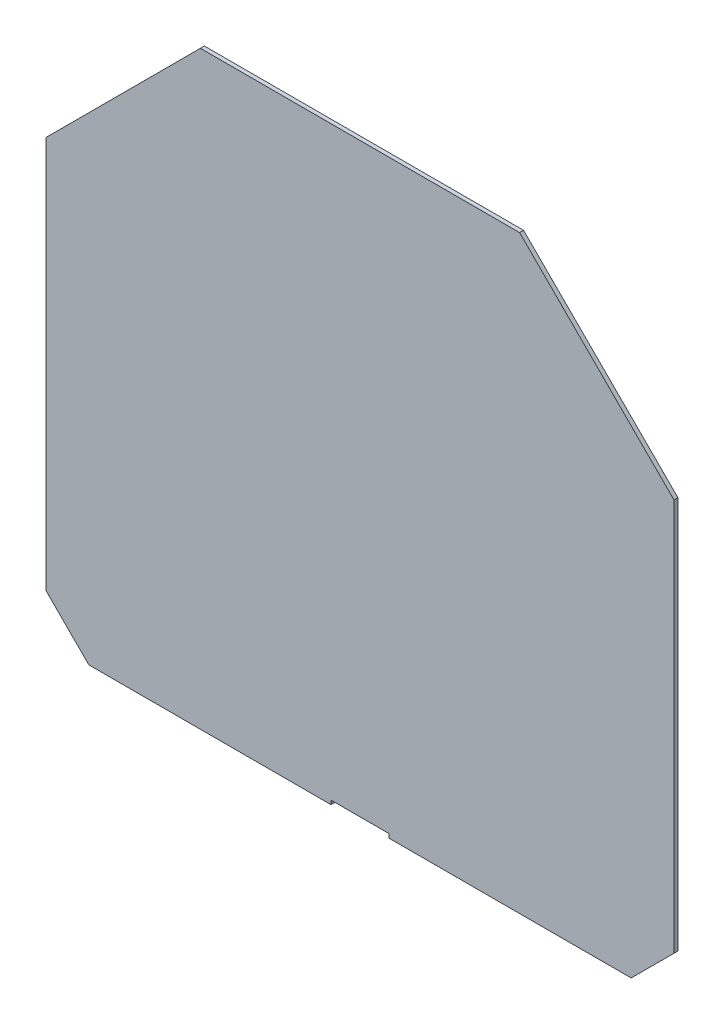
ISO-10303-21;
HEADER;
FILE_DESCRIPTION(('STEP AP214'),'2;1');
FILE_NAME('part.step','',(''),(''),'','','');
FILE_SCHEMA(('AUTOMOTIVE_DESIGN { 1 0 10303 214 1 1 1 1 }'));
ENDSEC;
DATA;
#1=APPLICATION_CONTEXT('core data for automotive mechanical design processes');
#2=APPLICATION_PROTOCOL_DEFINITION('international standard','automotive_design',2000,#1);
#3=PRODUCT_CONTEXT('',#1,'mechanical');
#4=PRODUCT('Part','Part','',(#3));
#5=PRODUCT_RELATED_PRODUCT_CATEGORY('part','',(#4));
#6=PRODUCT_DEFINITION_FORMATION('','',#4);
#7=PRODUCT_DEFINITION_CONTEXT('part definition',#1,'design');
#8=PRODUCT_DEFINITION('design','',#6,#7);
#9=PRODUCT_DEFINITION_SHAPE('','',#8);
#10=(LENGTH_UNIT() NAMED_UNIT(*) SI_UNIT(.MILLI.,.METRE.));
#11=(NAMED_UNIT(*) PLANE_ANGLE_UNIT() SI_UNIT($,.RADIAN.));
#12=(NAMED_UNIT(*) SI_UNIT($,.STERADIAN.) SOLID_ANGLE_UNIT());
#13=UNCERTAINTY_MEASURE_WITH_UNIT(LENGTH_MEASURE(1.E-05),#10,'distance_accuracy_value','');
#14=(GEOMETRIC_REPRESENTATION_CONTEXT(3) GLOBAL_UNCERTAINTY_ASSIGNED_CONTEXT((#13)) GLOBAL_UNIT_ASSIGNED_CONTEXT((#10,
#11,#12)) REPRESENTATION_CONTEXT('',''));
#15=CARTESIAN_POINT('',(0.,0.,0.));
#16=DIRECTION('',(0.,0.,1.));
#17=DIRECTION('',(1.,0.,0.));
#18=AXIS2_PLACEMENT_3D('',#15,#16,#17);
#19=CARTESIAN_POINT('',(-22.,-71.000002576039,3.));
#20=DIRECTION('',(-1.,0.,0.));
#21=DIRECTION('',(0.,-1.,0.));
#22=AXIS2_PLACEMENT_3D('',#19,#20,#21);
#23=PLANE('',#22);
#24=DIRECTION('',(0.,1.,0.));
#25=VECTOR('',#24,1.);
#26=CARTESIAN_POINT('',(-22.,-71.000002576039,0.));
#27=LINE('',#26,#25);
#28=CARTESIAN_POINT('',(-22.,-71.000002576039,0.));
#29=VERTEX_POINT('',#28);
#30=CARTESIAN_POINT('',(-22.,-68.000002576039,0.));
#31=VERTEX_POINT('',#30);
#32=EDGE_CURVE('E153',#29,#31,#27,.T.);
#33=ORIENTED_EDGE('',*,*,#32,.T.);
#34=DIRECTION('',(0.,0.,-1.));
#35=VECTOR('',#34,1.);
#36=CARTESIAN_POINT('',(-22.,-68.000002576039,3.));
#37=LINE('',#36,#35);
#38=CARTESIAN_POINT('',(-22.,-68.000002576039,3.));
#39=VERTEX_POINT('',#38);
#40=EDGE_CURVE('E11',#39,#31,#37,.T.);
#41=ORIENTED_EDGE('',*,*,#40,.F.);
#42=DIRECTION('',(0.,1.,0.));
#43=VECTOR('',#42,1.);
#44=CARTESIAN_POINT('',(-22.,-71.000002576039,3.));
#45=LINE('',#44,#43);
#46=CARTESIAN_POINT('',(-22.,-71.000002576039,3.));
#47=VERTEX_POINT('',#46);
#48=EDGE_CURVE('E175',#47,#39,#45,.T.);
#49=ORIENTED_EDGE('',*,*,#48,.F.);
#50=DIRECTION('',(0.,0.,-1.));
#51=VECTOR('',#50,1.);
#52=CARTESIAN_POINT('',(-22.,-71.000002576039,3.));
#53=LINE('',#52,#51);
#54=EDGE_CURVE('E149',#47,#29,#53,.T.);
#55=ORIENTED_EDGE('',*,*,#54,.T.);
#56=EDGE_LOOP('',(#33,#41,#49,#55));
#57=FACE_BOUND('',#56,.T.);
#58=ADVANCED_FACE('F33',(#57),#23,.F.);
#59=CARTESIAN_POINT('',(-22.,-68.000002576039,3.));
#60=DIRECTION('',(0.,1.,0.));
#61=DIRECTION('',(0.,0.,1.));
#62=AXIS2_PLACEMENT_3D('',#59,#60,#61);
#63=PLANE('',#62);
#64=DIRECTION('',(1.,0.,0.));
#65=VECTOR('',#64,1.);
#66=CARTESIAN_POINT('',(-22.,-68.000002576039,0.));
#67=LINE('',#66,#65);
#68=CARTESIAN_POINT('',(22.,-68.000002576039,0.));
#69=VERTEX_POINT('',#68);
#70=EDGE_CURVE('E156',#31,#69,#67,.T.);
#71=ORIENTED_EDGE('',*,*,#70,.T.);
#72=DIRECTION('',(0.,0.,-1.));
#73=VECTOR('',#72,1.);
#74=CARTESIAN_POINT('',(22.,-68.000002576039,3.));
#75=LINE('',#74,#73);
#76=CARTESIAN_POINT('',(22.,-68.000002576039,3.));
#77=VERTEX_POINT('',#76);
#78=EDGE_CURVE('E41',#77,#69,#75,.T.);
#79=ORIENTED_EDGE('',*,*,#78,.F.);
#80=DIRECTION('',(1.,0.,0.));
#81=VECTOR('',#80,1.);
#82=CARTESIAN_POINT('',(-22.,-68.000002576039,3.));
#83=LINE('',#82,#81);
#84=EDGE_CURVE('E104',#39,#77,#83,.T.);
#85=ORIENTED_EDGE('',*,*,#84,.F.);
#86=ORIENTED_EDGE('',*,*,#40,.T.);
#87=EDGE_LOOP('',(#71,#79,#85,#86));
#88=FACE_BOUND('',#87,.T.);
#89=ADVANCED_FACE('F253',(#88),#63,.F.);
#90=CARTESIAN_POINT('',(22.,-68.000002576039,3.));
#91=DIRECTION('',(1.,0.,0.));
#92=DIRECTION('',(0.,1.,0.));
#93=AXIS2_PLACEMENT_3D('',#90,#91,#92);
#94=PLANE('',#93);
#95=DIRECTION('',(0.,-1.,0.));
#96=VECTOR('',#95,1.);
#97=CARTESIAN_POINT('',(22.,-68.000002576039,0.));
#98=LINE('',#97,#96);
#99=CARTESIAN_POINT('',(22.,-71.000002576039,0.));
#100=VERTEX_POINT('',#99);
#101=EDGE_CURVE('E158',#69,#100,#98,.T.);
#102=ORIENTED_EDGE('',*,*,#101,.T.);
#103=DIRECTION('',(0.,0.,-1.));
#104=VECTOR('',#103,1.);
#105=CARTESIAN_POINT('',(22.,-71.000002576039,3.));
#106=LINE('',#105,#104);
#107=CARTESIAN_POINT('',(22.,-71.000002576039,3.));
#108=VERTEX_POINT('',#107);
#109=EDGE_CURVE('E194',#108,#100,#106,.T.);
#110=ORIENTED_EDGE('',*,*,#109,.F.);
#111=DIRECTION('',(0.,-1.,0.));
#112=VECTOR('',#111,1.);
#113=CARTESIAN_POINT('',(22.,-68.000002576039,3.));
#114=LINE('',#113,#112);
#115=EDGE_CURVE('E202',#77,#108,#114,.T.);
#116=ORIENTED_EDGE('',*,*,#115,.F.);
#117=ORIENTED_EDGE('',*,*,#78,.T.);
#118=EDGE_LOOP('',(#102,#110,#116,#117));
#119=FACE_BOUND('',#118,.T.);
#120=ADVANCED_FACE('F200',(#119),#94,.F.);
#121=CARTESIAN_POINT('',(22.,-71.000002576039,3.));
#122=DIRECTION('',(0.,1.,0.));
#123=DIRECTION('',(0.,0.,1.));
#124=AXIS2_PLACEMENT_3D('',#121,#122,#123);
#125=PLANE('',#124);
#126=DIRECTION('',(1.,0.,0.));
#127=VECTOR('',#126,1.);
#128=CARTESIAN_POINT('',(22.,-71.000002576039,0.));
#129=LINE('',#128,#127);
#130=CARTESIAN_POINT('',(205.356381253795,-71.000002576039,0.));
#131=VERTEX_POINT('',#130);
#132=EDGE_CURVE('E160',#100,#131,#129,.T.);
#133=ORIENTED_EDGE('',*,*,#132,.T.);
#134=DIRECTION('',(0.,0.,-1.));
#135=VECTOR('',#134,1.);
#136=CARTESIAN_POINT('',(205.356381253795,-71.000002576039,3.));
#137=LINE('',#136,#135);
#138=CARTESIAN_POINT('',(205.356381253795,-71.000002576039,3.));
#139=VERTEX_POINT('',#138);
#140=EDGE_CURVE('E191',#139,#131,#137,.T.);
#141=ORIENTED_EDGE('',*,*,#140,.F.);
#142=DIRECTION('',(1.,0.,0.));
#143=VECTOR('',#142,1.);
#144=CARTESIAN_POINT('',(22.,-71.000002576039,3.));
#145=LINE('',#144,#143);
#146=EDGE_CURVE('E220',#108,#139,#145,.T.);
#147=ORIENTED_EDGE('',*,*,#146,.F.);
#148=ORIENTED_EDGE('',*,*,#109,.T.);
#149=EDGE_LOOP('',(#133,#141,#147,#148));
#150=FACE_BOUND('',#149,.T.);
#151=ADVANCED_FACE('F211',(#150),#125,.F.);
#152=CARTESIAN_POINT('',(205.356381253795,-71.000002576039,3.));
#153=DIRECTION('',(-0.707106781186548,0.707106781186547,0.));
#154=DIRECTION('',(-0.707106781186547,-0.707106781186548,0.));
#155=AXIS2_PLACEMENT_3D('',#152,#153,#154);
#156=PLANE('',#155);
#157=DIRECTION('',(0.707106781186547,0.707106781186548,0.));
#158=VECTOR('',#157,1.);
#159=CARTESIAN_POINT('',(205.356381253795,-71.000002576039,0.));
#160=LINE('',#159,#158);
#161=CARTESIAN_POINT('',(237.80483880146,-38.5515450283748,0.));
#162=VERTEX_POINT('',#161);
#163=EDGE_CURVE('E162',#131,#162,#160,.T.);
#164=ORIENTED_EDGE('',*,*,#163,.T.);
#165=DIRECTION('',(0.,0.,-1.));
#166=VECTOR('',#165,1.);
#167=CARTESIAN_POINT('',(237.80483880146,-38.5515450283748,3.));
#168=LINE('',#167,#166);
#169=CARTESIAN_POINT('',(237.80483880146,-38.5515450283748,3.));
#170=VERTEX_POINT('',#169);
#171=EDGE_CURVE('E188',#170,#162,#168,.T.);
#172=ORIENTED_EDGE('',*,*,#171,.F.);
#173=DIRECTION('',(0.707106781186547,0.707106781186548,0.));
#174=VECTOR('',#173,1.);
#175=CARTESIAN_POINT('',(205.356381253795,-71.000002576039,3.));
#176=LINE('',#175,#174);
#177=EDGE_CURVE('E217',#139,#170,#176,.T.);
#178=ORIENTED_EDGE('',*,*,#177,.F.);
#179=ORIENTED_EDGE('',*,*,#140,.T.);
#180=EDGE_LOOP('',(#164,#172,#178,#179));
#181=FACE_BOUND('',#180,.T.);
#182=ADVANCED_FACE('F215',(#181),#156,.F.);
#183=CARTESIAN_POINT('',(237.80483880146,-38.5515450283748,3.));
#184=DIRECTION('',(-1.,0.,0.));
#185=DIRECTION('',(0.,0.,1.));
#186=AXIS2_PLACEMENT_3D('',#183,#184,#185);
#187=PLANE('',#186);
#188=DIRECTION('',(0.,1.,0.));
#189=VECTOR('',#188,1.);
#190=CARTESIAN_POINT('',(237.80483880146,-38.5515450283748,0.));
#191=LINE('',#190,#189);
#192=CARTESIAN_POINT('',(237.80483880146,258.722127635355,0.));
#193=VERTEX_POINT('',#192);
#194=EDGE_CURVE('E164',#162,#193,#191,.T.);
#195=ORIENTED_EDGE('',*,*,#194,.T.);
#196=DIRECTION('',(0.,0.,-1.));
#197=VECTOR('',#196,1.);
#198=CARTESIAN_POINT('',(237.80483880146,258.722127635355,3.));
#199=LINE('',#198,#197);
#200=CARTESIAN_POINT('',(237.80483880146,258.722127635355,3.));
#201=VERTEX_POINT('',#200);
#202=EDGE_CURVE('E185',#201,#193,#199,.T.);
#203=ORIENTED_EDGE('',*,*,#202,.F.);
#204=DIRECTION('',(0.,1.,0.));
#205=VECTOR('',#204,1.);
#206=CARTESIAN_POINT('',(237.80483880146,-38.5515450283748,3.));
#207=LINE('',#206,#205);
#208=EDGE_CURVE('E219',#170,#201,#207,.T.);
#209=ORIENTED_EDGE('',*,*,#208,.F.);
#210=ORIENTED_EDGE('',*,*,#171,.T.);
#211=EDGE_LOOP('',(#195,#203,#209,#210));
#212=FACE_BOUND('',#211,.T.);
#213=ADVANCED_FACE('F266',(#212),#187,.F.);
#214=CARTESIAN_POINT('',(237.80483880146,258.722127635355,3.));
#215=DIRECTION('',(-0.707106781186551,-0.707106781186544,0.));
#216=DIRECTION('',(0.707106781186544,-0.707106781186551,0.));
#217=AXIS2_PLACEMENT_3D('',#214,#215,#216);
#218=PLANE('',#217);
#219=DIRECTION('',(-0.707106781186544,0.707106781186551,0.));
#220=VECTOR('',#219,1.);
#221=CARTESIAN_POINT('',(237.80483880146,258.722127635355,0.));
#222=LINE('',#221,#220);
#223=CARTESIAN_POINT('',(120.878213037941,375.648753398874,0.));
#224=VERTEX_POINT('',#223);
#225=EDGE_CURVE('E166',#193,#224,#222,.T.);
#226=ORIENTED_EDGE('',*,*,#225,.T.);
#227=DIRECTION('',(0.,0.,-1.));
#228=VECTOR('',#227,1.);
#229=CARTESIAN_POINT('',(120.878213037941,375.648753398874,3.));
#230=LINE('',#229,#228);
#231=CARTESIAN_POINT('',(120.878213037941,375.648753398874,3.));
#232=VERTEX_POINT('',#231);
#233=EDGE_CURVE('E182',#232,#224,#230,.T.);
#234=ORIENTED_EDGE('',*,*,#233,.F.);
#235=DIRECTION('',(-0.707106781186544,0.707106781186551,0.));
#236=VECTOR('',#235,1.);
#237=CARTESIAN_POINT('',(237.80483880146,258.722127635355,3.));
#238=LINE('',#237,#236);
#239=EDGE_CURVE('E222',#201,#232,#238,.T.);
#240=ORIENTED_EDGE('',*,*,#239,.F.);
#241=ORIENTED_EDGE('',*,*,#202,.T.);
#242=EDGE_LOOP('',(#226,#234,#240,#241));
#243=FACE_BOUND('',#242,.T.);
#244=ADVANCED_FACE('F269',(#243),#218,.F.);
#245=CARTESIAN_POINT('',(120.878213037941,375.648753398874,3.));
#246=DIRECTION('',(0.,-1.,0.));
#247=DIRECTION('',(0.,0.,-1.));
#248=AXIS2_PLACEMENT_3D('',#245,#246,#247);
#249=PLANE('',#248);
#250=DIRECTION('',(-1.,0.,0.));
#251=VECTOR('',#250,1.);
#252=CARTESIAN_POINT('',(120.878213037941,375.648753398874,0.));
#253=LINE('',#252,#251);
#254=CARTESIAN_POINT('',(-120.878213037941,375.648753398874,0.));
#255=VERTEX_POINT('',#254);
#256=EDGE_CURVE('E168',#224,#255,#253,.T.);
#257=ORIENTED_EDGE('',*,*,#256,.T.);
#258=DIRECTION('',(0.,0.,-1.));
#259=VECTOR('',#258,1.);
#260=CARTESIAN_POINT('',(-120.878213037941,375.648753398874,3.));
#261=LINE('',#260,#259);
#262=CARTESIAN_POINT('',(-120.878213037941,375.648753398874,3.));
#263=VERTEX_POINT('',#262);
#264=EDGE_CURVE('E179',#263,#255,#261,.T.);
#265=ORIENTED_EDGE('',*,*,#264,.F.);
#266=DIRECTION('',(-1.,0.,0.));
#267=VECTOR('',#266,1.);
#268=CARTESIAN_POINT('',(120.878213037941,375.648753398874,3.));
#269=LINE('',#268,#267);
#270=EDGE_CURVE('E228',#232,#263,#269,.T.);
#271=ORIENTED_EDGE('',*,*,#270,.F.);
#272=ORIENTED_EDGE('',*,*,#233,.T.);
#273=EDGE_LOOP('',(#257,#265,#271,#272));
#274=FACE_BOUND('',#273,.T.);
#275=ADVANCED_FACE('F234',(#274),#249,.F.);
#276=CARTESIAN_POINT('',(-120.878213037941,375.648753398874,3.));
#277=DIRECTION('',(0.707106781186551,-0.707106781186544,0.));
#278=DIRECTION('',(0.707106781186544,0.707106781186551,0.));
#279=AXIS2_PLACEMENT_3D('',#276,#277,#278);
#280=PLANE('',#279);
#281=DIRECTION('',(-0.707106781186544,-0.707106781186551,0.));
#282=VECTOR('',#281,1.);
#283=CARTESIAN_POINT('',(-120.878213037941,375.648753398874,0.));
#284=LINE('',#283,#282);
#285=CARTESIAN_POINT('',(-237.80483880146,258.722127635355,0.));
#286=VERTEX_POINT('',#285);
#287=EDGE_CURVE('E170',#255,#286,#284,.T.);
#288=ORIENTED_EDGE('',*,*,#287,.T.);
#289=DIRECTION('',(0.,0.,-1.));
#290=VECTOR('',#289,1.);
#291=CARTESIAN_POINT('',(-237.80483880146,258.722127635355,3.));
#292=LINE('',#291,#290);
#293=CARTESIAN_POINT('',(-237.80483880146,258.722127635355,3.));
#294=VERTEX_POINT('',#293);
#295=EDGE_CURVE('E144',#294,#286,#292,.T.);
#296=ORIENTED_EDGE('',*,*,#295,.F.);
#297=DIRECTION('',(-0.707106781186544,-0.707106781186551,0.));
#298=VECTOR('',#297,1.);
#299=CARTESIAN_POINT('',(-120.878213037941,375.648753398874,3.));
#300=LINE('',#299,#298);
#301=EDGE_CURVE('E135',#263,#294,#300,.T.);
#302=ORIENTED_EDGE('',*,*,#301,.F.);
#303=ORIENTED_EDGE('',*,*,#264,.T.);
#304=EDGE_LOOP('',(#288,#296,#302,#303));
#305=FACE_BOUND('',#304,.T.);
#306=ADVANCED_FACE('F238',(#305),#280,.F.);
#307=CARTESIAN_POINT('',(-237.80483880146,258.722127635355,3.));
#308=DIRECTION('',(1.,0.,0.));
#309=DIRECTION('',(0.,0.,-1.));
#310=AXIS2_PLACEMENT_3D('',#307,#308,#309);
#311=PLANE('',#310);
#312=DIRECTION('',(0.,-1.,0.));
#313=VECTOR('',#312,1.);
#314=CARTESIAN_POINT('',(-237.80483880146,258.722127635355,0.));
#315=LINE('',#314,#313);
#316=CARTESIAN_POINT('',(-237.80483880146,-38.5515450283748,0.));
#317=VERTEX_POINT('',#316);
#318=EDGE_CURVE('E143',#286,#317,#315,.T.);
#319=ORIENTED_EDGE('',*,*,#318,.T.);
#320=DIRECTION('',(0.,0.,-1.));
#321=VECTOR('',#320,1.);
#322=CARTESIAN_POINT('',(-237.80483880146,-38.5515450283748,3.));
#323=LINE('',#322,#321);
#324=CARTESIAN_POINT('',(-237.80483880146,-38.5515450283748,3.));
#325=VERTEX_POINT('',#324);
#326=EDGE_CURVE('E140',#325,#317,#323,.T.);
#327=ORIENTED_EDGE('',*,*,#326,.F.);
#328=DIRECTION('',(0.,-1.,0.));
#329=VECTOR('',#328,1.);
#330=CARTESIAN_POINT('',(-237.80483880146,258.722127635355,3.));
#331=LINE('',#330,#329);
#332=EDGE_CURVE('E129',#294,#325,#331,.T.);
#333=ORIENTED_EDGE('',*,*,#332,.F.);
#334=ORIENTED_EDGE('',*,*,#295,.T.);
#335=EDGE_LOOP('',(#319,#327,#333,#334));
#336=FACE_BOUND('',#335,.T.);
#337=ADVANCED_FACE('F141',(#336),#311,.F.);
#338=CARTESIAN_POINT('',(-237.80483880146,-38.5515450283748,3.));
#339=DIRECTION('',(0.707106781186548,0.707106781186547,0.));
#340=DIRECTION('',(-0.707106781186547,0.707106781186548,0.));
#341=AXIS2_PLACEMENT_3D('',#338,#339,#340);
#342=PLANE('',#341);
#343=DIRECTION('',(0.707106781186547,-0.707106781186548,0.));
#344=VECTOR('',#343,1.);
#345=CARTESIAN_POINT('',(-237.80483880146,-38.5515450283748,0.));
#346=LINE('',#345,#344);
#347=CARTESIAN_POINT('',(-205.356381253795,-71.000002576039,0.));
#348=VERTEX_POINT('',#347);
#349=EDGE_CURVE('E90',#317,#348,#346,.T.);
#350=ORIENTED_EDGE('',*,*,#349,.T.);
#351=DIRECTION('',(0.,0.,-1.));
#352=VECTOR('',#351,1.);
#353=CARTESIAN_POINT('',(-205.356381253795,-71.000002576039,3.));
#354=LINE('',#353,#352);
#355=CARTESIAN_POINT('',(-205.356381253795,-71.000002576039,3.));
#356=VERTEX_POINT('',#355);
#357=EDGE_CURVE('E145',#356,#348,#354,.T.);
#358=ORIENTED_EDGE('',*,*,#357,.F.);
#359=DIRECTION('',(0.707106781186547,-0.707106781186548,0.));
#360=VECTOR('',#359,1.);
#361=CARTESIAN_POINT('',(-237.80483880146,-38.5515450283748,3.));
#362=LINE('',#361,#360);
#363=EDGE_CURVE('E133',#325,#356,#362,.T.);
#364=ORIENTED_EDGE('',*,*,#363,.F.);
#365=ORIENTED_EDGE('',*,*,#326,.T.);
#366=EDGE_LOOP('',(#350,#358,#364,#365));
#367=FACE_BOUND('',#366,.T.);
#368=ADVANCED_FACE('F147',(#367),#342,.F.);
#369=CARTESIAN_POINT('',(-205.356381253795,-71.000002576039,3.));
#370=DIRECTION('',(0.,1.,0.));
#371=DIRECTION('',(0.,0.,1.));
#372=AXIS2_PLACEMENT_3D('',#369,#370,#371);
#373=PLANE('',#372);
#374=DIRECTION('',(1.,0.,0.));
#375=VECTOR('',#374,1.);
#376=CARTESIAN_POINT('',(-205.356381253795,-71.000002576039,0.));
#377=LINE('',#376,#375);
#378=EDGE_CURVE('E96',#348,#29,#377,.T.);
#379=ORIENTED_EDGE('',*,*,#378,.T.);
#380=ORIENTED_EDGE('',*,*,#54,.F.);
#381=DIRECTION('',(1.,0.,0.));
#382=VECTOR('',#381,1.);
#383=CARTESIAN_POINT('',(-205.356381253795,-71.000002576039,3.));
#384=LINE('',#383,#382);
#385=EDGE_CURVE('E49',#356,#47,#384,.T.);
#386=ORIENTED_EDGE('',*,*,#385,.F.);
#387=ORIENTED_EDGE('',*,*,#357,.T.);
#388=EDGE_LOOP('',(#379,#380,#386,#387));
#389=FACE_BOUND('',#388,.T.);
#390=ADVANCED_FACE('F242',(#389),#373,.F.);
#391=CARTESIAN_POINT('',(0.,0.,3.));
#392=DIRECTION('',(0.,0.,-1.));
#393=DIRECTION('',(-1.,0.,0.));
#394=AXIS2_PLACEMENT_3D('',#391,#392,#393);
#395=PLANE('',#394);
#396=ORIENTED_EDGE('',*,*,#48,.T.);
#397=ORIENTED_EDGE('',*,*,#84,.T.);
#398=ORIENTED_EDGE('',*,*,#115,.T.);
#399=ORIENTED_EDGE('',*,*,#146,.T.);
#400=ORIENTED_EDGE('',*,*,#177,.T.);
#401=ORIENTED_EDGE('',*,*,#208,.T.);
#402=ORIENTED_EDGE('',*,*,#239,.T.);
#403=ORIENTED_EDGE('',*,*,#270,.T.);
#404=ORIENTED_EDGE('',*,*,#301,.T.);
#405=ORIENTED_EDGE('',*,*,#332,.T.);
#406=ORIENTED_EDGE('',*,*,#363,.T.);
#407=ORIENTED_EDGE('',*,*,#385,.T.);
#408=EDGE_LOOP('',(#396,#397,#398,#399,#400,#401,#402,#403,#404,#405,#406,#407));
#409=FACE_BOUND('',#408,.T.);
#410=ADVANCED_FACE('F131',(#409),#395,.F.);
#411=CARTESIAN_POINT('',(0.,0.,0.));
#412=DIRECTION('',(0.,0.,-1.));
#413=DIRECTION('',(-1.,0.,0.));
#414=AXIS2_PLACEMENT_3D('',#411,#412,#413);
#415=PLANE('',#414);
#416=ORIENTED_EDGE('',*,*,#32,.F.);
#417=ORIENTED_EDGE('',*,*,#378,.F.);
#418=ORIENTED_EDGE('',*,*,#349,.F.);
#419=ORIENTED_EDGE('',*,*,#318,.F.);
#420=ORIENTED_EDGE('',*,*,#287,.F.);
#421=ORIENTED_EDGE('',*,*,#256,.F.);
#422=ORIENTED_EDGE('',*,*,#225,.F.);
#423=ORIENTED_EDGE('',*,*,#194,.F.);
#424=ORIENTED_EDGE('',*,*,#163,.F.);
#425=ORIENTED_EDGE('',*,*,#132,.F.);
#426=ORIENTED_EDGE('',*,*,#101,.F.);
#427=ORIENTED_EDGE('',*,*,#70,.F.);
#428=EDGE_LOOP('',(#416,#417,#418,#419,#420,#421,#422,#423,#424,#425,#426,#427));
#429=FACE_BOUND('',#428,.T.);
#430=ADVANCED_FACE('F206',(#429),#415,.T.);
#431=CLOSED_SHELL('',(#58,#89,#120,#151,#182,#213,#244,#275,#306,#337,#368,#390,#410,#430));
#432=MANIFOLD_SOLID_BREP('B2',#431);
#433=ADVANCED_BREP_SHAPE_REPRESENTATION('',(#18,#432),#14);
#434=SHAPE_DEFINITION_REPRESENTATION(#9,#433);
ENDSEC;
END-ISO-10303-21;
